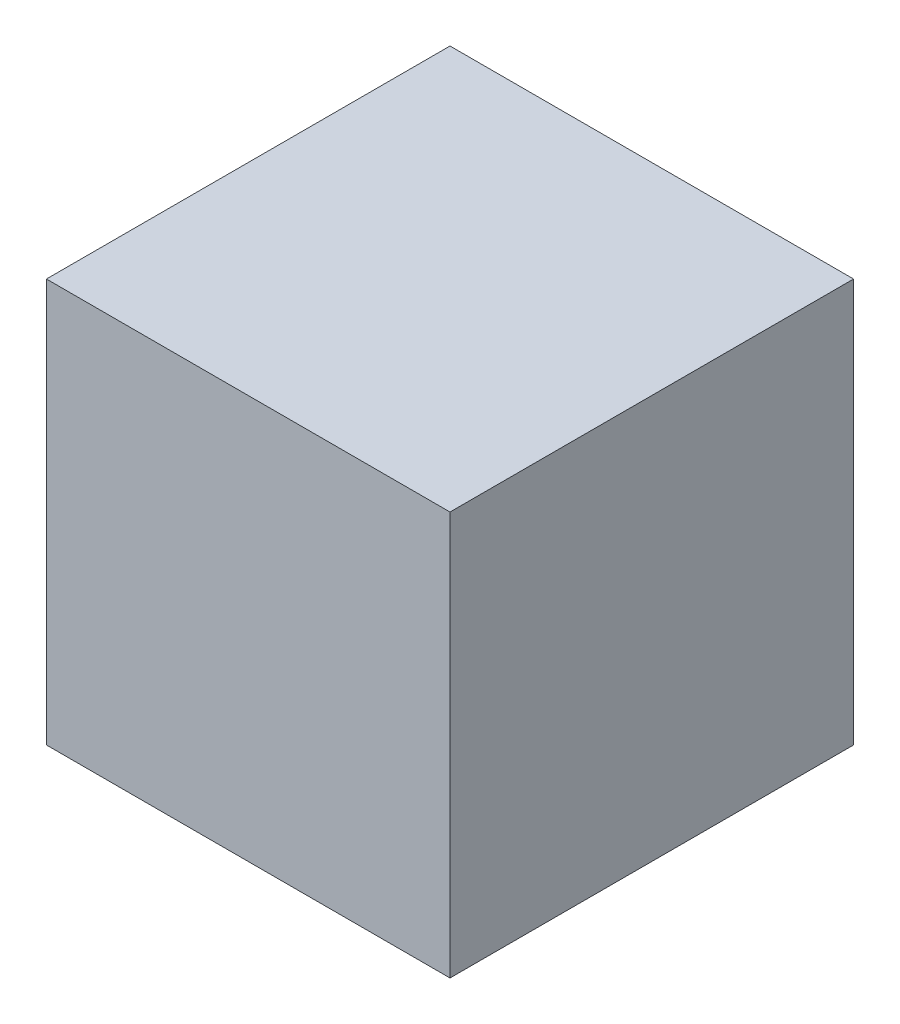
ISO-10303-21;
HEADER;
FILE_DESCRIPTION(('STEP AP214'),'2;1');
FILE_NAME('part.step','',(''),(''),'','','');
FILE_SCHEMA(('AUTOMOTIVE_DESIGN { 1 0 10303 214 1 1 1 1 }'));
ENDSEC;
DATA;
#1=APPLICATION_CONTEXT('core data for automotive mechanical design processes');
#2=APPLICATION_PROTOCOL_DEFINITION('international standard','automotive_design',2000,#1);
#3=PRODUCT_CONTEXT('',#1,'mechanical');
#4=PRODUCT('Part','Part','',(#3));
#5=PRODUCT_RELATED_PRODUCT_CATEGORY('part','',(#4));
#6=PRODUCT_DEFINITION_FORMATION('','',#4);
#7=PRODUCT_DEFINITION_CONTEXT('part definition',#1,'design');
#8=PRODUCT_DEFINITION('design','',#6,#7);
#9=PRODUCT_DEFINITION_SHAPE('','',#8);
#10=(LENGTH_UNIT() NAMED_UNIT(*) SI_UNIT(.MILLI.,.METRE.));
#11=(NAMED_UNIT(*) PLANE_ANGLE_UNIT() SI_UNIT($,.RADIAN.));
#12=(NAMED_UNIT(*) SI_UNIT($,.STERADIAN.) SOLID_ANGLE_UNIT());
#13=UNCERTAINTY_MEASURE_WITH_UNIT(LENGTH_MEASURE(1.E-05),#10,'distance_accuracy_value','');
#14=(GEOMETRIC_REPRESENTATION_CONTEXT(3) GLOBAL_UNCERTAINTY_ASSIGNED_CONTEXT((#13)) GLOBAL_UNIT_ASSIGNED_CONTEXT((#10,
#11,#12)) REPRESENTATION_CONTEXT('',''));
#15=CARTESIAN_POINT('',(0.,0.,0.));
#16=DIRECTION('',(0.,0.,1.));
#17=DIRECTION('',(1.,0.,0.));
#18=AXIS2_PLACEMENT_3D('',#15,#16,#17);
#19=CARTESIAN_POINT('',(-26.5,26.5,-26.5));
#20=DIRECTION('',(0.,0.,-1.));
#21=DIRECTION('',(-1.,0.,0.));
#22=AXIS2_PLACEMENT_3D('',#19,#20,#21);
#23=PLANE('',#22);
#24=DIRECTION('',(1.,0.,0.));
#25=VECTOR('',#24,1.);
#26=CARTESIAN_POINT('',(-26.5,-26.5,-26.5));
#27=LINE('',#26,#25);
#28=CARTESIAN_POINT('',(-26.5,-26.5,-26.5));
#29=VERTEX_POINT('',#28);
#30=CARTESIAN_POINT('',(26.5,-26.5,-26.5));
#31=VERTEX_POINT('',#30);
#32=EDGE_CURVE('E98',#29,#31,#27,.T.);
#33=ORIENTED_EDGE('',*,*,#32,.F.);
#34=DIRECTION('',(0.,-1.,0.));
#35=VECTOR('',#34,1.);
#36=CARTESIAN_POINT('',(-26.5,26.5,-26.5));
#37=LINE('',#36,#35);
#38=CARTESIAN_POINT('',(-26.5,26.5,-26.5));
#39=VERTEX_POINT('',#38);
#40=EDGE_CURVE('E11',#39,#29,#37,.T.);
#41=ORIENTED_EDGE('',*,*,#40,.F.);
#42=DIRECTION('',(1.,0.,0.));
#43=VECTOR('',#42,1.);
#44=CARTESIAN_POINT('',(-26.5,26.5,-26.5));
#45=LINE('',#44,#43);
#46=CARTESIAN_POINT('',(26.5,26.5,-26.5));
#47=VERTEX_POINT('',#46);
#48=EDGE_CURVE('E93',#39,#47,#45,.T.);
#49=ORIENTED_EDGE('',*,*,#48,.T.);
#50=DIRECTION('',(0.,-1.,0.));
#51=VECTOR('',#50,1.);
#52=CARTESIAN_POINT('',(26.5,26.5,-26.5));
#53=LINE('',#52,#51);
#54=EDGE_CURVE('E36',#47,#31,#53,.T.);
#55=ORIENTED_EDGE('',*,*,#54,.T.);
#56=EDGE_LOOP('',(#33,#41,#49,#55));
#57=FACE_BOUND('',#56,.T.);
#58=ADVANCED_FACE('F33',(#57),#23,.T.);
#59=CARTESIAN_POINT('',(-26.5,26.5,-26.5));
#60=DIRECTION('',(1.,0.,0.));
#61=DIRECTION('',(0.,0.,-1.));
#62=AXIS2_PLACEMENT_3D('',#59,#60,#61);
#63=PLANE('',#62);
#64=DIRECTION('',(0.,0.,1.));
#65=VECTOR('',#64,1.);
#66=CARTESIAN_POINT('',(-26.5,-26.5,-26.5));
#67=LINE('',#66,#65);
#68=CARTESIAN_POINT('',(-26.5,-26.5,26.5));
#69=VERTEX_POINT('',#68);
#70=EDGE_CURVE('E66',#29,#69,#67,.T.);
#71=ORIENTED_EDGE('',*,*,#70,.T.);
#72=DIRECTION('',(0.,-1.,0.));
#73=VECTOR('',#72,1.);
#74=CARTESIAN_POINT('',(-26.5,26.5,26.5));
#75=LINE('',#74,#73);
#76=CARTESIAN_POINT('',(-26.5,26.5,26.5));
#77=VERTEX_POINT('',#76);
#78=EDGE_CURVE('E42',#77,#69,#75,.T.);
#79=ORIENTED_EDGE('',*,*,#78,.F.);
#80=DIRECTION('',(0.,0.,1.));
#81=VECTOR('',#80,1.);
#82=CARTESIAN_POINT('',(-26.5,26.5,-26.5));
#83=LINE('',#82,#81);
#84=EDGE_CURVE('E83',#39,#77,#83,.T.);
#85=ORIENTED_EDGE('',*,*,#84,.F.);
#86=ORIENTED_EDGE('',*,*,#40,.T.);
#87=EDGE_LOOP('',(#71,#79,#85,#86));
#88=FACE_BOUND('',#87,.T.);
#89=ADVANCED_FACE('F108',(#88),#63,.F.);
#90=CARTESIAN_POINT('',(-26.5,26.5,26.5));
#91=DIRECTION('',(0.,0.,-1.));
#92=DIRECTION('',(-1.,0.,0.));
#93=AXIS2_PLACEMENT_3D('',#90,#91,#92);
#94=PLANE('',#93);
#95=DIRECTION('',(1.,0.,0.));
#96=VECTOR('',#95,1.);
#97=CARTESIAN_POINT('',(-26.5,-26.5,26.5));
#98=LINE('',#97,#96);
#99=CARTESIAN_POINT('',(26.5,-26.5,26.5));
#100=VERTEX_POINT('',#99);
#101=EDGE_CURVE('E90',#69,#100,#98,.T.);
#102=ORIENTED_EDGE('',*,*,#101,.T.);
#103=DIRECTION('',(0.,-1.,0.));
#104=VECTOR('',#103,1.);
#105=CARTESIAN_POINT('',(26.5,26.5,26.5));
#106=LINE('',#105,#104);
#107=CARTESIAN_POINT('',(26.5,26.5,26.5));
#108=VERTEX_POINT('',#107);
#109=EDGE_CURVE('E87',#108,#100,#106,.T.);
#110=ORIENTED_EDGE('',*,*,#109,.F.);
#111=DIRECTION('',(1.,0.,0.));
#112=VECTOR('',#111,1.);
#113=CARTESIAN_POINT('',(-26.5,26.5,26.5));
#114=LINE('',#113,#112);
#115=EDGE_CURVE('E78',#77,#108,#114,.T.);
#116=ORIENTED_EDGE('',*,*,#115,.F.);
#117=ORIENTED_EDGE('',*,*,#78,.T.);
#118=EDGE_LOOP('',(#102,#110,#116,#117));
#119=FACE_BOUND('',#118,.T.);
#120=ADVANCED_FACE('F88',(#119),#94,.F.);
#121=CARTESIAN_POINT('',(26.5,26.5,-26.5));
#122=DIRECTION('',(1.,0.,0.));
#123=DIRECTION('',(0.,0.,-1.));
#124=AXIS2_PLACEMENT_3D('',#121,#122,#123);
#125=PLANE('',#124);
#126=DIRECTION('',(0.,0.,1.));
#127=VECTOR('',#126,1.);
#128=CARTESIAN_POINT('',(26.5,-26.5,-26.5));
#129=LINE('',#128,#127);
#130=EDGE_CURVE('E101',#31,#100,#129,.T.);
#131=ORIENTED_EDGE('',*,*,#130,.F.);
#132=ORIENTED_EDGE('',*,*,#54,.F.);
#133=DIRECTION('',(0.,0.,1.));
#134=VECTOR('',#133,1.);
#135=CARTESIAN_POINT('',(26.5,26.5,-26.5));
#136=LINE('',#135,#134);
#137=EDGE_CURVE('E82',#47,#108,#136,.T.);
#138=ORIENTED_EDGE('',*,*,#137,.T.);
#139=ORIENTED_EDGE('',*,*,#109,.T.);
#140=EDGE_LOOP('',(#131,#132,#138,#139));
#141=FACE_BOUND('',#140,.T.);
#142=ADVANCED_FACE('F92',(#141),#125,.T.);
#143=CARTESIAN_POINT('',(0.,26.5,0.));
#144=DIRECTION('',(0.,-1.,0.));
#145=DIRECTION('',(0.,0.,-1.));
#146=AXIS2_PLACEMENT_3D('',#143,#144,#145);
#147=PLANE('',#146);
#148=ORIENTED_EDGE('',*,*,#48,.F.);
#149=ORIENTED_EDGE('',*,*,#84,.T.);
#150=ORIENTED_EDGE('',*,*,#115,.T.);
#151=ORIENTED_EDGE('',*,*,#137,.F.);
#152=EDGE_LOOP('',(#148,#149,#150,#151));
#153=FACE_BOUND('',#152,.T.);
#154=ADVANCED_FACE('F81',(#153),#147,.F.);
#155=CARTESIAN_POINT('',(0.,-26.5,0.));
#156=DIRECTION('',(0.,-1.,0.));
#157=DIRECTION('',(0.,0.,-1.));
#158=AXIS2_PLACEMENT_3D('',#155,#156,#157);
#159=PLANE('',#158);
#160=ORIENTED_EDGE('',*,*,#32,.T.);
#161=ORIENTED_EDGE('',*,*,#130,.T.);
#162=ORIENTED_EDGE('',*,*,#101,.F.);
#163=ORIENTED_EDGE('',*,*,#70,.F.);
#164=EDGE_LOOP('',(#160,#161,#162,#163));
#165=FACE_BOUND('',#164,.T.);
#166=ADVANCED_FACE('F106',(#165),#159,.T.);
#167=CLOSED_SHELL('',(#58,#89,#120,#142,#154,#166));
#168=MANIFOLD_SOLID_BREP('B2',#167);
#169=ADVANCED_BREP_SHAPE_REPRESENTATION('',(#18,#168),#14);
#170=SHAPE_DEFINITION_REPRESENTATION(#9,#169);
ENDSEC;
END-ISO-10303-21;
